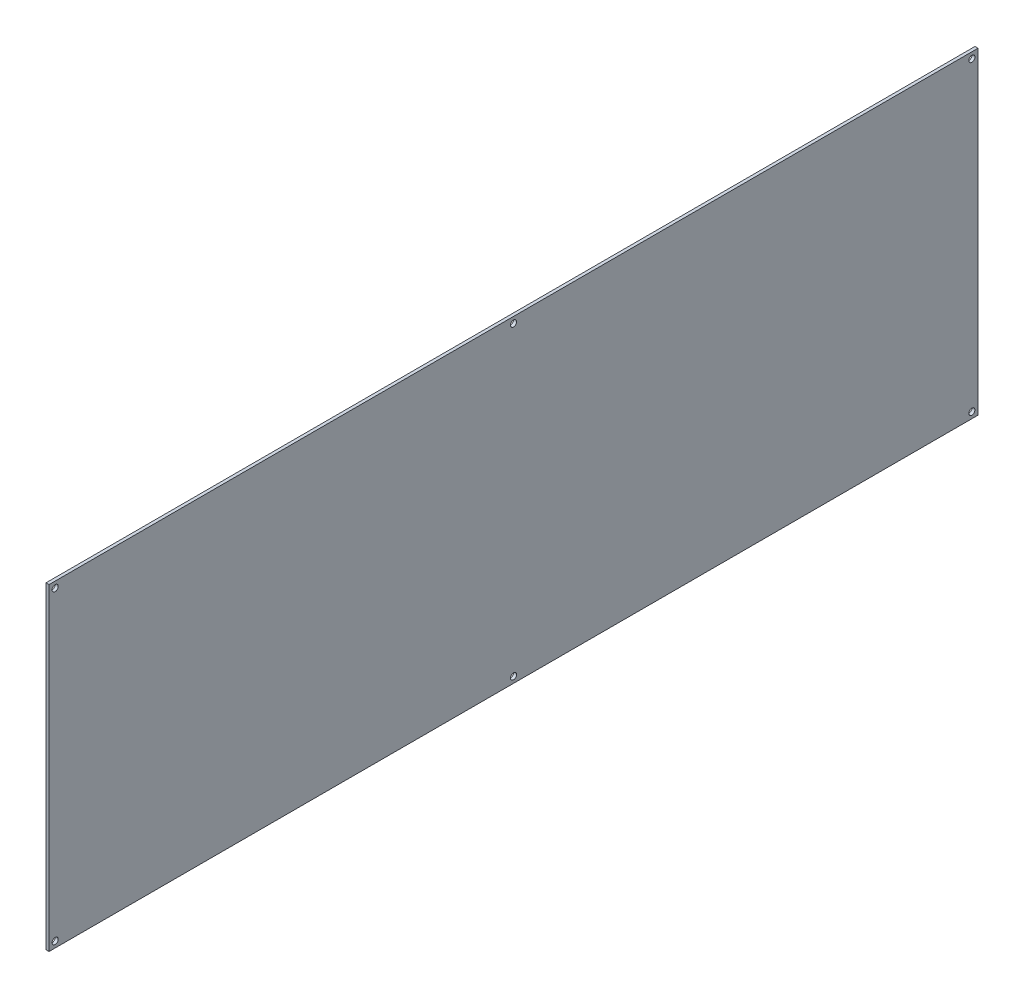
ISO-10303-21;
HEADER;
FILE_DESCRIPTION(('STEP AP214'),'2;1');
FILE_NAME('part.step','',(''),(''),'','','');
FILE_SCHEMA(('AUTOMOTIVE_DESIGN { 1 0 10303 214 1 1 1 1 }'));
ENDSEC;
DATA;
#1=APPLICATION_CONTEXT('core data for automotive mechanical design processes');
#2=APPLICATION_PROTOCOL_DEFINITION('international standard','automotive_design',2000,#1);
#3=PRODUCT_CONTEXT('',#1,'mechanical');
#4=PRODUCT('Part','Part','',(#3));
#5=PRODUCT_RELATED_PRODUCT_CATEGORY('part','',(#4));
#6=PRODUCT_DEFINITION_FORMATION('','',#4);
#7=PRODUCT_DEFINITION_CONTEXT('part definition',#1,'design');
#8=PRODUCT_DEFINITION('design','',#6,#7);
#9=PRODUCT_DEFINITION_SHAPE('','',#8);
#10=(LENGTH_UNIT() NAMED_UNIT(*) SI_UNIT(.MILLI.,.METRE.));
#11=(NAMED_UNIT(*) PLANE_ANGLE_UNIT() SI_UNIT($,.RADIAN.));
#12=(NAMED_UNIT(*) SI_UNIT($,.STERADIAN.) SOLID_ANGLE_UNIT());
#13=UNCERTAINTY_MEASURE_WITH_UNIT(LENGTH_MEASURE(1.E-05),#10,'distance_accuracy_value','');
#14=(GEOMETRIC_REPRESENTATION_CONTEXT(3) GLOBAL_UNCERTAINTY_ASSIGNED_CONTEXT((#13)) GLOBAL_UNIT_ASSIGNED_CONTEXT((#10,
#11,#12)) REPRESENTATION_CONTEXT('',''));
#15=CARTESIAN_POINT('',(0.,0.,0.));
#16=DIRECTION('',(0.,0.,1.));
#17=DIRECTION('',(1.,0.,0.));
#18=AXIS2_PLACEMENT_3D('',#15,#16,#17);
#19=CARTESIAN_POINT('',(-612.775,145.412583971024,717.55));
#20=DIRECTION('',(-1.,0.,0.));
#21=DIRECTION('',(0.,-1.,0.));
#22=AXIS2_PLACEMENT_3D('',#19,#20,#21);
#23=PLANE('',#22);
#24=CARTESIAN_POINT('',(-612.775,281.300167942047,1428.75));
#25=DIRECTION('',(-1.,0.,0.));
#26=DIRECTION('',(0.,-1.,0.));
#27=AXIS2_PLACEMENT_3D('',#24,#25,#26);
#28=CIRCLE('',#27,3.175);
#29=CARTESIAN_POINT('',(-612.775,278.125167942047,1428.75));
#30=VERTEX_POINT('',#29);
#31=EDGE_CURVE('E95',#30,#30,#28,.T.);
#32=ORIENTED_EDGE('',*,*,#31,.T.);
#33=EDGE_LOOP('',(#32));
#34=FACE_BOUND('',#33,.T.);
#35=CARTESIAN_POINT('',(-612.775,281.300167942047,476.25));
#36=DIRECTION('',(-1.,0.,0.));
#37=DIRECTION('',(0.,-1.,0.));
#38=AXIS2_PLACEMENT_3D('',#35,#36,#37);
#39=CIRCLE('',#38,3.175);
#40=CARTESIAN_POINT('',(-612.775,278.125167942047,476.25));
#41=VERTEX_POINT('',#40);
#42=EDGE_CURVE('E101',#41,#41,#39,.T.);
#43=ORIENTED_EDGE('',*,*,#42,.T.);
#44=EDGE_LOOP('',(#43));
#45=FACE_BOUND('',#44,.T.);
#46=CARTESIAN_POINT('',(-612.775,-36.1998320579524,476.25));
#47=DIRECTION('',(-1.,0.,0.));
#48=DIRECTION('',(0.,-1.,0.));
#49=AXIS2_PLACEMENT_3D('',#46,#47,#48);
#50=CIRCLE('',#49,3.175);
#51=CARTESIAN_POINT('',(-612.775,-39.3748320579524,476.25));
#52=VERTEX_POINT('',#51);
#53=EDGE_CURVE('E17',#52,#52,#50,.T.);
#54=ORIENTED_EDGE('',*,*,#53,.T.);
#55=EDGE_LOOP('',(#54));
#56=FACE_BOUND('',#55,.T.);
#57=CARTESIAN_POINT('',(-612.775,-36.1998320579525,952.5));
#58=DIRECTION('',(-1.,0.,0.));
#59=DIRECTION('',(0.,-1.,0.));
#60=AXIS2_PLACEMENT_3D('',#57,#58,#59);
#61=CIRCLE('',#60,3.175);
#62=CARTESIAN_POINT('',(-612.775,-39.3748320579525,952.5));
#63=VERTEX_POINT('',#62);
#64=EDGE_CURVE('E105',#63,#63,#61,.T.);
#65=ORIENTED_EDGE('',*,*,#64,.T.);
#66=EDGE_LOOP('',(#65));
#67=FACE_BOUND('',#66,.T.);
#68=CARTESIAN_POINT('',(-612.775,-36.1998320579526,1428.75));
#69=DIRECTION('',(-1.,0.,0.));
#70=DIRECTION('',(0.,-1.,0.));
#71=AXIS2_PLACEMENT_3D('',#68,#69,#70);
#72=CIRCLE('',#71,3.175);
#73=CARTESIAN_POINT('',(-612.775,-39.3748320579526,1428.75));
#74=VERTEX_POINT('',#73);
#75=EDGE_CURVE('E65',#74,#74,#72,.T.);
#76=ORIENTED_EDGE('',*,*,#75,.T.);
#77=EDGE_LOOP('',(#76));
#78=FACE_BOUND('',#77,.T.);
#79=DIRECTION('',(0.,1.,0.));
#80=VECTOR('',#79,1.);
#81=CARTESIAN_POINT('',(-612.775,158.152591437101,1435.1));
#82=LINE('',#81,#80);
#83=CARTESIAN_POINT('',(-612.775,-42.5498320579526,1435.1));
#84=VERTEX_POINT('',#83);
#85=CARTESIAN_POINT('',(-612.775,287.650167942048,1435.1));
#86=VERTEX_POINT('',#85);
#87=EDGE_CURVE('E259',#84,#86,#82,.T.);
#88=ORIENTED_EDGE('',*,*,#87,.F.);
#89=DIRECTION('',(0.,0.,1.));
#90=VECTOR('',#89,1.);
#91=CARTESIAN_POINT('',(-612.775,-42.5498320579526,920.75));
#92=LINE('',#91,#90);
#93=CARTESIAN_POINT('',(-612.775,-42.5498320579527,469.9));
#94=VERTEX_POINT('',#93);
#95=EDGE_CURVE('E52',#94,#84,#92,.T.);
#96=ORIENTED_EDGE('',*,*,#95,.F.);
#97=DIRECTION('',(0.,1.,0.));
#98=VECTOR('',#97,1.);
#99=CARTESIAN_POINT('',(-612.775,158.152591437101,469.9));
#100=LINE('',#99,#98);
#101=CARTESIAN_POINT('',(-612.775,287.650167942048,469.9));
#102=VERTEX_POINT('',#101);
#103=EDGE_CURVE('E67',#94,#102,#100,.T.);
#104=ORIENTED_EDGE('',*,*,#103,.T.);
#105=DIRECTION('',(0.,0.,1.));
#106=VECTOR('',#105,1.);
#107=CARTESIAN_POINT('',(-612.775,287.650167942048,920.75));
#108=LINE('',#107,#106);
#109=EDGE_CURVE('E57',#102,#86,#108,.T.);
#110=ORIENTED_EDGE('',*,*,#109,.T.);
#111=EDGE_LOOP('',(#88,#96,#104,#110));
#112=FACE_BOUND('',#111,.T.);
#113=CARTESIAN_POINT('',(-612.775,281.300167942047,952.5));
#114=DIRECTION('',(-1.,0.,0.));
#115=DIRECTION('',(0.,-1.,0.));
#116=AXIS2_PLACEMENT_3D('',#113,#114,#115);
#117=CIRCLE('',#116,3.175);
#118=CARTESIAN_POINT('',(-612.775,278.125167942047,952.5));
#119=VERTEX_POINT('',#118);
#120=EDGE_CURVE('E98',#119,#119,#117,.T.);
#121=ORIENTED_EDGE('',*,*,#120,.T.);
#122=EDGE_LOOP('',(#121));
#123=FACE_BOUND('',#122,.T.);
#124=ADVANCED_FACE('F14',(#34,#45,#56,#67,#78,#112,#123),#23,.F.);
#125=CARTESIAN_POINT('',(-615.95,-36.1998320579524,476.25));
#126=DIRECTION('',(-1.,0.,0.));
#127=DIRECTION('',(0.,-1.,0.));
#128=AXIS2_PLACEMENT_3D('',#125,#126,#127);
#129=CYLINDRICAL_SURFACE('',#128,3.175);
#130=ORIENTED_EDGE('',*,*,#53,.F.);
#131=EDGE_LOOP('',(#130));
#132=FACE_BOUND('',#131,.T.);
#133=CARTESIAN_POINT('',(-615.95,-36.1998320579524,476.25));
#134=DIRECTION('',(-1.,0.,0.));
#135=DIRECTION('',(0.,-1.,0.));
#136=AXIS2_PLACEMENT_3D('',#133,#134,#135);
#137=CIRCLE('',#136,3.175);
#138=CARTESIAN_POINT('',(-615.95,-39.3748320579524,476.25));
#139=VERTEX_POINT('',#138);
#140=EDGE_CURVE('E92',#139,#139,#137,.F.);
#141=ORIENTED_EDGE('',*,*,#140,.F.);
#142=EDGE_LOOP('',(#141));
#143=FACE_BOUND('',#142,.T.);
#144=ADVANCED_FACE('F113',(#132,#143),#129,.F.);
#145=CARTESIAN_POINT('',(-615.95,-36.1998320579525,952.5));
#146=DIRECTION('',(-1.,0.,0.));
#147=DIRECTION('',(0.,-1.,0.));
#148=AXIS2_PLACEMENT_3D('',#145,#146,#147);
#149=CYLINDRICAL_SURFACE('',#148,3.175);
#150=ORIENTED_EDGE('',*,*,#64,.F.);
#151=EDGE_LOOP('',(#150));
#152=FACE_BOUND('',#151,.T.);
#153=CARTESIAN_POINT('',(-615.95,-36.1998320579525,952.5));
#154=DIRECTION('',(-1.,0.,0.));
#155=DIRECTION('',(0.,-1.,0.));
#156=AXIS2_PLACEMENT_3D('',#153,#154,#155);
#157=CIRCLE('',#156,3.175);
#158=CARTESIAN_POINT('',(-615.95,-39.3748320579525,952.5));
#159=VERTEX_POINT('',#158);
#160=EDGE_CURVE('E89',#159,#159,#157,.F.);
#161=ORIENTED_EDGE('',*,*,#160,.F.);
#162=EDGE_LOOP('',(#161));
#163=FACE_BOUND('',#162,.T.);
#164=ADVANCED_FACE('F116',(#152,#163),#149,.F.);
#165=CARTESIAN_POINT('',(-615.95,-36.1998320579526,1428.75));
#166=DIRECTION('',(-1.,0.,0.));
#167=DIRECTION('',(0.,-1.,0.));
#168=AXIS2_PLACEMENT_3D('',#165,#166,#167);
#169=CYLINDRICAL_SURFACE('',#168,3.175);
#170=ORIENTED_EDGE('',*,*,#75,.F.);
#171=EDGE_LOOP('',(#170));
#172=FACE_BOUND('',#171,.T.);
#173=CARTESIAN_POINT('',(-615.95,-36.1998320579526,1428.75));
#174=DIRECTION('',(-1.,0.,0.));
#175=DIRECTION('',(0.,-1.,0.));
#176=AXIS2_PLACEMENT_3D('',#173,#174,#175);
#177=CIRCLE('',#176,3.175);
#178=CARTESIAN_POINT('',(-615.95,-39.3748320579526,1428.75));
#179=VERTEX_POINT('',#178);
#180=EDGE_CURVE('E85',#179,#179,#177,.F.);
#181=ORIENTED_EDGE('',*,*,#180,.F.);
#182=EDGE_LOOP('',(#181));
#183=FACE_BOUND('',#182,.T.);
#184=ADVANCED_FACE('F151',(#172,#183),#169,.F.);
#185=CARTESIAN_POINT('',(-615.95,287.650167942048,920.75));
#186=DIRECTION('',(0.,-1.,0.));
#187=DIRECTION('',(1.,0.,0.));
#188=AXIS2_PLACEMENT_3D('',#185,#186,#187);
#189=PLANE('',#188);
#190=DIRECTION('',(1.,0.,0.));
#191=VECTOR('',#190,1.);
#192=CARTESIAN_POINT('',(-615.95,287.650167942048,469.9));
#193=LINE('',#192,#191);
#194=CARTESIAN_POINT('',(-615.95,287.650167942048,469.9));
#195=VERTEX_POINT('',#194);
#196=EDGE_CURVE('E60',#102,#195,#193,.F.);
#197=ORIENTED_EDGE('',*,*,#196,.T.);
#198=DIRECTION('',(0.,0.,1.));
#199=VECTOR('',#198,1.);
#200=CARTESIAN_POINT('',(-615.95,287.650167942048,717.55));
#201=LINE('',#200,#199);
#202=CARTESIAN_POINT('',(-615.95,287.650167942048,1435.1));
#203=VERTEX_POINT('',#202);
#204=EDGE_CURVE('E88',#203,#195,#201,.F.);
#205=ORIENTED_EDGE('',*,*,#204,.F.);
#206=DIRECTION('',(1.,0.,0.));
#207=VECTOR('',#206,1.);
#208=CARTESIAN_POINT('',(-615.95,287.650167942048,1435.1));
#209=LINE('',#208,#207);
#210=EDGE_CURVE('E63',#86,#203,#209,.F.);
#211=ORIENTED_EDGE('',*,*,#210,.F.);
#212=ORIENTED_EDGE('',*,*,#109,.F.);
#213=EDGE_LOOP('',(#197,#205,#211,#212));
#214=FACE_BOUND('',#213,.T.);
#215=ADVANCED_FACE('F58',(#214),#189,.F.);
#216=CARTESIAN_POINT('',(-615.95,158.152591437101,469.9));
#217=DIRECTION('',(0.,0.,1.));
#218=DIRECTION('',(1.,0.,0.));
#219=AXIS2_PLACEMENT_3D('',#216,#217,#218);
#220=PLANE('',#219);
#221=DIRECTION('',(1.,0.,0.));
#222=VECTOR('',#221,1.);
#223=CARTESIAN_POINT('',(-615.95,-42.5498320579526,469.9));
#224=LINE('',#223,#222);
#225=CARTESIAN_POINT('',(-615.95,-42.5498320579527,469.9));
#226=VERTEX_POINT('',#225);
#227=EDGE_CURVE('E261',#226,#94,#224,.T.);
#228=ORIENTED_EDGE('',*,*,#227,.F.);
#229=DIRECTION('',(0.,-1.,0.));
#230=VECTOR('',#229,1.);
#231=CARTESIAN_POINT('',(-615.95,145.412583971024,469.9));
#232=LINE('',#231,#230);
#233=EDGE_CURVE('E74',#195,#226,#232,.T.);
#234=ORIENTED_EDGE('',*,*,#233,.F.);
#235=ORIENTED_EDGE('',*,*,#196,.F.);
#236=ORIENTED_EDGE('',*,*,#103,.F.);
#237=EDGE_LOOP('',(#228,#234,#235,#236));
#238=FACE_BOUND('',#237,.T.);
#239=ADVANCED_FACE('F72',(#238),#220,.F.);
#240=CARTESIAN_POINT('',(-615.95,-42.5498320579526,920.75));
#241=DIRECTION('',(0.,-1.,0.));
#242=DIRECTION('',(1.,0.,0.));
#243=AXIS2_PLACEMENT_3D('',#240,#241,#242);
#244=PLANE('',#243);
#245=DIRECTION('',(0.,0.,1.));
#246=VECTOR('',#245,1.);
#247=CARTESIAN_POINT('',(-615.95,-42.5498320579527,717.55));
#248=LINE('',#247,#246);
#249=CARTESIAN_POINT('',(-615.95,-42.5498320579526,1435.1));
#250=VERTEX_POINT('',#249);
#251=EDGE_CURVE('E249',#226,#250,#248,.T.);
#252=ORIENTED_EDGE('',*,*,#251,.F.);
#253=ORIENTED_EDGE('',*,*,#227,.T.);
#254=ORIENTED_EDGE('',*,*,#95,.T.);
#255=DIRECTION('',(1.,0.,0.));
#256=VECTOR('',#255,1.);
#257=CARTESIAN_POINT('',(-615.95,-42.5498320579526,1435.1));
#258=LINE('',#257,#256);
#259=EDGE_CURVE('E32',#250,#84,#258,.T.);
#260=ORIENTED_EDGE('',*,*,#259,.F.);
#261=EDGE_LOOP('',(#252,#253,#254,#260));
#262=FACE_BOUND('',#261,.T.);
#263=ADVANCED_FACE('F143',(#262),#244,.T.);
#264=CARTESIAN_POINT('',(-615.95,158.152591437101,1435.1));
#265=DIRECTION('',(0.,0.,1.));
#266=DIRECTION('',(1.,0.,0.));
#267=AXIS2_PLACEMENT_3D('',#264,#265,#266);
#268=PLANE('',#267);
#269=DIRECTION('',(0.,-1.,0.));
#270=VECTOR('',#269,1.);
#271=CARTESIAN_POINT('',(-615.95,145.412583971024,1435.1));
#272=LINE('',#271,#270);
#273=EDGE_CURVE('E84',#250,#203,#272,.F.);
#274=ORIENTED_EDGE('',*,*,#273,.F.);
#275=ORIENTED_EDGE('',*,*,#259,.T.);
#276=ORIENTED_EDGE('',*,*,#87,.T.);
#277=ORIENTED_EDGE('',*,*,#210,.T.);
#278=EDGE_LOOP('',(#274,#275,#276,#277));
#279=FACE_BOUND('',#278,.T.);
#280=ADVANCED_FACE('F139',(#279),#268,.T.);
#281=CARTESIAN_POINT('',(-615.95,281.300167942047,476.25));
#282=DIRECTION('',(-1.,0.,0.));
#283=DIRECTION('',(0.,-1.,0.));
#284=AXIS2_PLACEMENT_3D('',#281,#282,#283);
#285=CYLINDRICAL_SURFACE('',#284,3.175);
#286=ORIENTED_EDGE('',*,*,#42,.F.);
#287=EDGE_LOOP('',(#286));
#288=FACE_BOUND('',#287,.T.);
#289=CARTESIAN_POINT('',(-615.95,281.300167942047,476.25));
#290=DIRECTION('',(-1.,0.,0.));
#291=DIRECTION('',(0.,-1.,0.));
#292=AXIS2_PLACEMENT_3D('',#289,#290,#291);
#293=CIRCLE('',#292,3.175);
#294=CARTESIAN_POINT('',(-615.95,278.125167942047,476.25));
#295=VERTEX_POINT('',#294);
#296=EDGE_CURVE('E81',#295,#295,#293,.F.);
#297=ORIENTED_EDGE('',*,*,#296,.F.);
#298=EDGE_LOOP('',(#297));
#299=FACE_BOUND('',#298,.T.);
#300=ADVANCED_FACE('F135',(#288,#299),#285,.F.);
#301=CARTESIAN_POINT('',(-615.95,281.300167942047,952.5));
#302=DIRECTION('',(-1.,0.,0.));
#303=DIRECTION('',(0.,-1.,0.));
#304=AXIS2_PLACEMENT_3D('',#301,#302,#303);
#305=CYLINDRICAL_SURFACE('',#304,3.175);
#306=ORIENTED_EDGE('',*,*,#120,.F.);
#307=EDGE_LOOP('',(#306));
#308=FACE_BOUND('',#307,.T.);
#309=CARTESIAN_POINT('',(-615.95,281.300167942047,952.5));
#310=DIRECTION('',(-1.,0.,0.));
#311=DIRECTION('',(0.,-1.,0.));
#312=AXIS2_PLACEMENT_3D('',#309,#310,#311);
#313=CIRCLE('',#312,3.175);
#314=CARTESIAN_POINT('',(-615.95,278.125167942047,952.5));
#315=VERTEX_POINT('',#314);
#316=EDGE_CURVE('E23',#315,#315,#313,.F.);
#317=ORIENTED_EDGE('',*,*,#316,.F.);
#318=EDGE_LOOP('',(#317));
#319=FACE_BOUND('',#318,.T.);
#320=ADVANCED_FACE('F128',(#308,#319),#305,.F.);
#321=CARTESIAN_POINT('',(-615.95,281.300167942047,1428.75));
#322=DIRECTION('',(-1.,0.,0.));
#323=DIRECTION('',(0.,-1.,0.));
#324=AXIS2_PLACEMENT_3D('',#321,#322,#323);
#325=CYLINDRICAL_SURFACE('',#324,3.175);
#326=ORIENTED_EDGE('',*,*,#31,.F.);
#327=EDGE_LOOP('',(#326));
#328=FACE_BOUND('',#327,.T.);
#329=CARTESIAN_POINT('',(-615.95,281.300167942047,1428.75));
#330=DIRECTION('',(-1.,0.,0.));
#331=DIRECTION('',(0.,-1.,0.));
#332=AXIS2_PLACEMENT_3D('',#329,#330,#331);
#333=CIRCLE('',#332,3.175);
#334=CARTESIAN_POINT('',(-615.95,278.125167942047,1428.75));
#335=VERTEX_POINT('',#334);
#336=EDGE_CURVE('E9',#335,#335,#333,.F.);
#337=ORIENTED_EDGE('',*,*,#336,.F.);
#338=EDGE_LOOP('',(#337));
#339=FACE_BOUND('',#338,.T.);
#340=ADVANCED_FACE('F121',(#328,#339),#325,.F.);
#341=CARTESIAN_POINT('',(-615.95,145.412583971024,717.55));
#342=DIRECTION('',(-1.,0.,0.));
#343=DIRECTION('',(0.,-1.,0.));
#344=AXIS2_PLACEMENT_3D('',#341,#342,#343);
#345=PLANE('',#344);
#346=ORIENTED_EDGE('',*,*,#336,.T.);
#347=EDGE_LOOP('',(#346));
#348=FACE_BOUND('',#347,.T.);
#349=ORIENTED_EDGE('',*,*,#316,.T.);
#350=EDGE_LOOP('',(#349));
#351=FACE_BOUND('',#350,.T.);
#352=ORIENTED_EDGE('',*,*,#296,.T.);
#353=EDGE_LOOP('',(#352));
#354=FACE_BOUND('',#353,.T.);
#355=ORIENTED_EDGE('',*,*,#251,.T.);
#356=ORIENTED_EDGE('',*,*,#273,.T.);
#357=ORIENTED_EDGE('',*,*,#204,.T.);
#358=ORIENTED_EDGE('',*,*,#233,.T.);
#359=EDGE_LOOP('',(#355,#356,#357,#358));
#360=FACE_BOUND('',#359,.T.);
#361=ORIENTED_EDGE('',*,*,#180,.T.);
#362=EDGE_LOOP('',(#361));
#363=FACE_BOUND('',#362,.T.);
#364=ORIENTED_EDGE('',*,*,#160,.T.);
#365=EDGE_LOOP('',(#364));
#366=FACE_BOUND('',#365,.T.);
#367=ORIENTED_EDGE('',*,*,#140,.T.);
#368=EDGE_LOOP('',(#367));
#369=FACE_BOUND('',#368,.T.);
#370=ADVANCED_FACE('F119',(#348,#351,#354,#360,#363,#366,#369),#345,.T.);
#371=CLOSED_SHELL('',(#124,#144,#164,#184,#215,#239,#263,#280,#300,#320,#340,#370));
#372=MANIFOLD_SOLID_BREP('B1',#371);
#373=ADVANCED_BREP_SHAPE_REPRESENTATION('',(#18,#372),#14);
#374=SHAPE_DEFINITION_REPRESENTATION(#9,#373);
ENDSEC;
END-ISO-10303-21;
